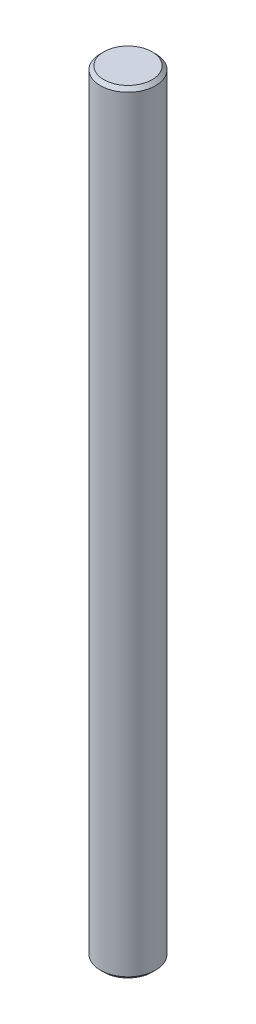
ISO-10303-21;
HEADER;
FILE_DESCRIPTION(('STEP AP214'),'2;1');
FILE_NAME('part.step','',(''),(''),'','','');
FILE_SCHEMA(('AUTOMOTIVE_DESIGN { 1 0 10303 214 1 1 1 1 }'));
ENDSEC;
DATA;
#1=APPLICATION_CONTEXT('core data for automotive mechanical design processes');
#2=APPLICATION_PROTOCOL_DEFINITION('international standard','automotive_design',2000,#1);
#3=PRODUCT_CONTEXT('',#1,'mechanical');
#4=PRODUCT('Part','Part','',(#3));
#5=PRODUCT_RELATED_PRODUCT_CATEGORY('part','',(#4));
#6=PRODUCT_DEFINITION_FORMATION('','',#4);
#7=PRODUCT_DEFINITION_CONTEXT('part definition',#1,'design');
#8=PRODUCT_DEFINITION('design','',#6,#7);
#9=PRODUCT_DEFINITION_SHAPE('','',#8);
#10=(LENGTH_UNIT() NAMED_UNIT(*) SI_UNIT(.MILLI.,.METRE.));
#11=(NAMED_UNIT(*) PLANE_ANGLE_UNIT() SI_UNIT($,.RADIAN.));
#12=(NAMED_UNIT(*) SI_UNIT($,.STERADIAN.) SOLID_ANGLE_UNIT());
#13=UNCERTAINTY_MEASURE_WITH_UNIT(LENGTH_MEASURE(1.E-05),#10,'distance_accuracy_value','');
#14=(GEOMETRIC_REPRESENTATION_CONTEXT(3) GLOBAL_UNCERTAINTY_ASSIGNED_CONTEXT((#13)) GLOBAL_UNIT_ASSIGNED_CONTEXT((#10,
#11,#12)) REPRESENTATION_CONTEXT('',''));
#15=CARTESIAN_POINT('',(0.,0.,0.));
#16=DIRECTION('',(0.,0.,1.));
#17=DIRECTION('',(1.,0.,0.));
#18=AXIS2_PLACEMENT_3D('',#15,#16,#17);
#19=CARTESIAN_POINT('',(0.,112.,0.));
#20=DIRECTION('',(0.,-1.,0.));
#21=DIRECTION('',(0.,0.,-1.));
#22=AXIS2_PLACEMENT_3D('',#19,#20,#21);
#23=CYLINDRICAL_SURFACE('',#22,4.);
#24=CARTESIAN_POINT('',(0.,0.500000000000028,0.));
#25=DIRECTION('',(0.,1.,0.));
#26=DIRECTION('',(0.,0.,1.));
#27=AXIS2_PLACEMENT_3D('',#24,#25,#26);
#28=CIRCLE('',#27,4.);
#29=CARTESIAN_POINT('',(0.,0.500000000000028,4.));
#30=VERTEX_POINT('',#29);
#31=EDGE_CURVE('E44',#30,#30,#28,.T.);
#32=ORIENTED_EDGE('',*,*,#31,.T.);
#33=EDGE_LOOP('',(#32));
#34=FACE_BOUND('',#33,.T.);
#35=CARTESIAN_POINT('',(0.,111.5,0.));
#36=DIRECTION('',(0.,1.,0.));
#37=DIRECTION('',(0.,0.,1.));
#38=AXIS2_PLACEMENT_3D('',#35,#36,#37);
#39=CIRCLE('',#38,4.);
#40=CARTESIAN_POINT('',(0.,111.5,4.));
#41=VERTEX_POINT('',#40);
#42=EDGE_CURVE('E48',#41,#41,#39,.F.);
#43=ORIENTED_EDGE('',*,*,#42,.T.);
#44=EDGE_LOOP('',(#43));
#45=FACE_BOUND('',#44,.T.);
#46=ADVANCED_FACE('F32',(#34,#45),#23,.T.);
#47=CARTESIAN_POINT('',(0.,112.,0.));
#48=DIRECTION('',(0.,1.,0.));
#49=DIRECTION('',(0.,0.,1.));
#50=AXIS2_PLACEMENT_3D('',#47,#48,#49);
#51=PLANE('',#50);
#52=CARTESIAN_POINT('',(0.,112.,0.));
#53=DIRECTION('',(0.,1.,0.));
#54=DIRECTION('',(0.,0.,1.));
#55=AXIS2_PLACEMENT_3D('',#52,#53,#54);
#56=CIRCLE('',#55,3.50000000000002);
#57=CARTESIAN_POINT('',(0.,112.,3.50000000000002));
#58=VERTEX_POINT('',#57);
#59=EDGE_CURVE('E10',#58,#58,#56,.T.);
#60=ORIENTED_EDGE('',*,*,#59,.T.);
#61=EDGE_LOOP('',(#60));
#62=FACE_BOUND('',#61,.T.);
#63=ADVANCED_FACE('F64',(#62),#51,.T.);
#64=CARTESIAN_POINT('',(0.,0.,0.));
#65=DIRECTION('',(0.,1.,0.));
#66=DIRECTION('',(0.,0.,1.));
#67=AXIS2_PLACEMENT_3D('',#64,#65,#66);
#68=PLANE('',#67);
#69=CARTESIAN_POINT('',(0.,0.,0.));
#70=DIRECTION('',(0.,1.,0.));
#71=DIRECTION('',(0.,0.,1.));
#72=AXIS2_PLACEMENT_3D('',#69,#70,#71);
#73=CIRCLE('',#72,3.49999999999998);
#74=CARTESIAN_POINT('',(0.,0.,3.49999999999998));
#75=VERTEX_POINT('',#74);
#76=EDGE_CURVE('E40',#75,#75,#73,.F.);
#77=ORIENTED_EDGE('',*,*,#76,.T.);
#78=EDGE_LOOP('',(#77));
#79=FACE_BOUND('',#78,.T.);
#80=ADVANCED_FACE('F61',(#79),#68,.F.);
#81=CARTESIAN_POINT('',(0.,0.500000000000028,0.));
#82=DIRECTION('',(0.,1.,0.));
#83=DIRECTION('',(0.,0.,1.));
#84=AXIS2_PLACEMENT_3D('',#81,#82,#83);
#85=CONICAL_SURFACE('',#84,4.,0.785398163397445);
#86=ORIENTED_EDGE('',*,*,#76,.F.);
#87=EDGE_LOOP('',(#86));
#88=FACE_BOUND('',#87,.T.);
#89=ORIENTED_EDGE('',*,*,#31,.F.);
#90=EDGE_LOOP('',(#89));
#91=FACE_BOUND('',#90,.T.);
#92=ADVANCED_FACE('F57',(#88,#91),#85,.T.);
#93=CARTESIAN_POINT('',(0.,112.,0.));
#94=DIRECTION('',(0.,-1.,0.));
#95=DIRECTION('',(0.,0.,-1.));
#96=AXIS2_PLACEMENT_3D('',#93,#94,#95);
#97=CONICAL_SURFACE('',#96,3.50000000000002,0.785398163397445);
#98=ORIENTED_EDGE('',*,*,#42,.F.);
#99=EDGE_LOOP('',(#98));
#100=FACE_BOUND('',#99,.T.);
#101=ORIENTED_EDGE('',*,*,#59,.F.);
#102=EDGE_LOOP('',(#101));
#103=FACE_BOUND('',#102,.T.);
#104=ADVANCED_FACE('F35',(#100,#103),#97,.T.);
#105=CLOSED_SHELL('',(#46,#63,#80,#92,#104));
#106=MANIFOLD_SOLID_BREP('B2',#105);
#107=ADVANCED_BREP_SHAPE_REPRESENTATION('',(#18,#106),#14);
#108=SHAPE_DEFINITION_REPRESENTATION(#9,#107);
ENDSEC;
END-ISO-10303-21;
